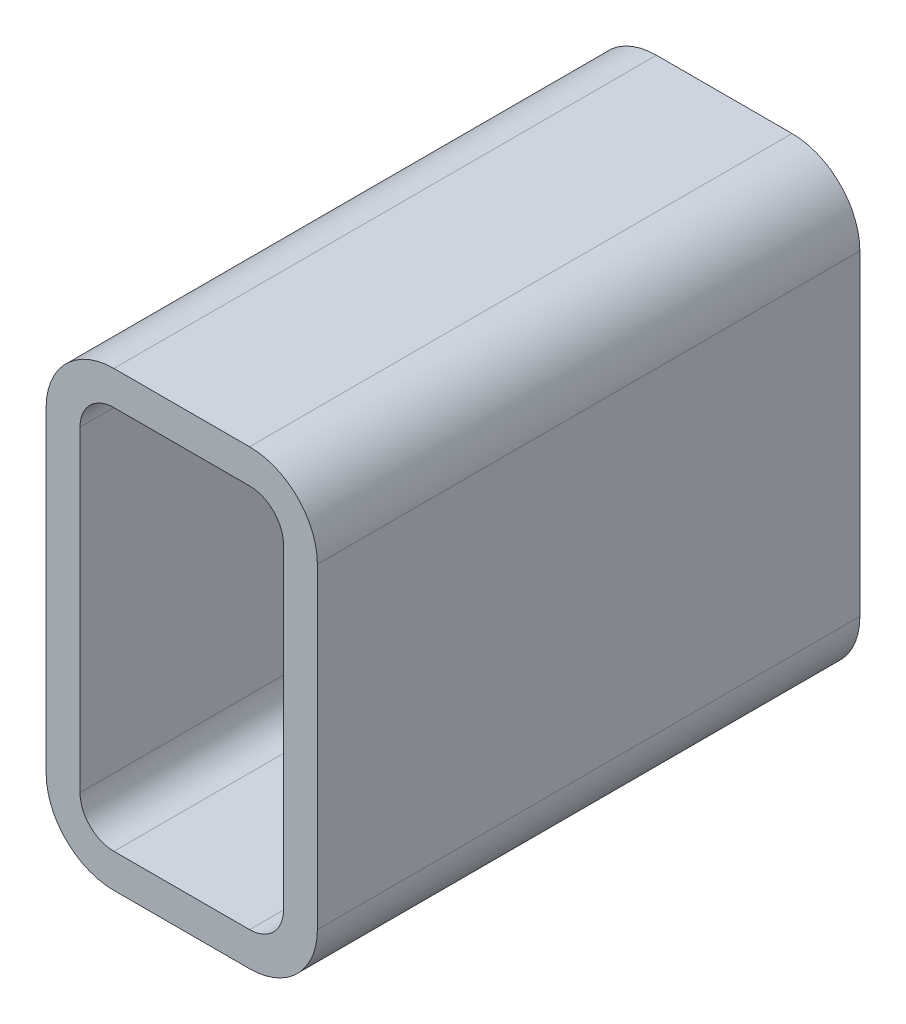
ISO-10303-21;
HEADER;
FILE_DESCRIPTION(('STEP AP214'),'2;1');
FILE_NAME('part.step','',(''),(''),'','','');
FILE_SCHEMA(('AUTOMOTIVE_DESIGN { 1 0 10303 214 1 1 1 1 }'));
ENDSEC;
DATA;
#1=APPLICATION_CONTEXT('core data for automotive mechanical design processes');
#2=APPLICATION_PROTOCOL_DEFINITION('international standard','automotive_design',2000,#1);
#3=PRODUCT_CONTEXT('',#1,'mechanical');
#4=PRODUCT('Part','Part','',(#3));
#5=PRODUCT_RELATED_PRODUCT_CATEGORY('part','',(#4));
#6=PRODUCT_DEFINITION_FORMATION('','',#4);
#7=PRODUCT_DEFINITION_CONTEXT('part definition',#1,'design');
#8=PRODUCT_DEFINITION('design','',#6,#7);
#9=PRODUCT_DEFINITION_SHAPE('','',#8);
#10=(LENGTH_UNIT() NAMED_UNIT(*) SI_UNIT(.MILLI.,.METRE.));
#11=(NAMED_UNIT(*) PLANE_ANGLE_UNIT() SI_UNIT($,.RADIAN.));
#12=(NAMED_UNIT(*) SI_UNIT($,.STERADIAN.) SOLID_ANGLE_UNIT());
#13=UNCERTAINTY_MEASURE_WITH_UNIT(LENGTH_MEASURE(1.E-05),#10,'distance_accuracy_value','');
#14=(GEOMETRIC_REPRESENTATION_CONTEXT(3) GLOBAL_UNCERTAINTY_ASSIGNED_CONTEXT((#13)) GLOBAL_UNIT_ASSIGNED_CONTEXT((#10,
#11,#12)) REPRESENTATION_CONTEXT('',''));
#15=CARTESIAN_POINT('',(0.,0.,0.));
#16=DIRECTION('',(0.,0.,1.));
#17=DIRECTION('',(1.,0.,0.));
#18=AXIS2_PLACEMENT_3D('',#15,#16,#17);
#19=CARTESIAN_POINT('',(57.15,107.95,76.2));
#20=DIRECTION('',(0.,0.,1.));
#21=DIRECTION('',(1.,0.,0.));
#22=AXIS2_PLACEMENT_3D('',#19,#20,#21);
#23=PLANE('',#22);
#24=CARTESIAN_POINT('',(57.15,107.95,76.2));
#25=DIRECTION('',(0.,0.,1.));
#26=DIRECTION('',(1.,0.,0.));
#27=AXIS2_PLACEMENT_3D('',#24,#25,#26);
#28=CIRCLE('',#27,19.05);
#29=CARTESIAN_POINT('',(76.2,107.95,76.2));
#30=VERTEX_POINT('',#29);
#31=CARTESIAN_POINT('',(57.15,127.,76.2));
#32=VERTEX_POINT('',#31);
#33=EDGE_CURVE('E215',#30,#32,#28,.T.);
#34=ORIENTED_EDGE('',*,*,#33,.T.);
#35=DIRECTION('',(-1.,0.,0.));
#36=VECTOR('',#35,1.);
#37=CARTESIAN_POINT('',(57.15,127.,76.2));
#38=LINE('',#37,#36);
#39=CARTESIAN_POINT('',(19.05,127.,76.2));
#40=VERTEX_POINT('',#39);
#41=EDGE_CURVE('E218',#32,#40,#38,.T.);
#42=ORIENTED_EDGE('',*,*,#41,.T.);
#43=CARTESIAN_POINT('',(19.05,107.95,76.2));
#44=DIRECTION('',(0.,0.,1.));
#45=DIRECTION('',(1.,0.,0.));
#46=AXIS2_PLACEMENT_3D('',#43,#44,#45);
#47=CIRCLE('',#46,19.05);
#48=CARTESIAN_POINT('',(0.,107.95,76.2));
#49=VERTEX_POINT('',#48);
#50=EDGE_CURVE('E221',#40,#49,#47,.T.);
#51=ORIENTED_EDGE('',*,*,#50,.T.);
#52=DIRECTION('',(0.,-1.,0.));
#53=VECTOR('',#52,1.);
#54=CARTESIAN_POINT('',(0.,19.05,76.2));
#55=LINE('',#54,#53);
#56=CARTESIAN_POINT('',(0.,19.05,76.2));
#57=VERTEX_POINT('',#56);
#58=EDGE_CURVE('E223',#49,#57,#55,.T.);
#59=ORIENTED_EDGE('',*,*,#58,.T.);
#60=CARTESIAN_POINT('',(19.05,19.05,76.2));
#61=DIRECTION('',(0.,0.,1.));
#62=DIRECTION('',(1.,0.,0.));
#63=AXIS2_PLACEMENT_3D('',#60,#61,#62);
#64=CIRCLE('',#63,19.05);
#65=CARTESIAN_POINT('',(19.05,0.,76.2));
#66=VERTEX_POINT('',#65);
#67=EDGE_CURVE('E225',#57,#66,#64,.T.);
#68=ORIENTED_EDGE('',*,*,#67,.T.);
#69=DIRECTION('',(1.,0.,0.));
#70=VECTOR('',#69,1.);
#71=CARTESIAN_POINT('',(19.05,0.,76.2));
#72=LINE('',#71,#70);
#73=CARTESIAN_POINT('',(57.15,0.,76.2));
#74=VERTEX_POINT('',#73);
#75=EDGE_CURVE('E227',#66,#74,#72,.T.);
#76=ORIENTED_EDGE('',*,*,#75,.T.);
#77=CARTESIAN_POINT('',(57.15,19.05,76.2));
#78=DIRECTION('',(0.,0.,1.));
#79=DIRECTION('',(1.,0.,0.));
#80=AXIS2_PLACEMENT_3D('',#77,#78,#79);
#81=CIRCLE('',#80,19.05);
#82=CARTESIAN_POINT('',(76.2,19.05,76.2));
#83=VERTEX_POINT('',#82);
#84=EDGE_CURVE('E229',#74,#83,#81,.T.);
#85=ORIENTED_EDGE('',*,*,#84,.T.);
#86=DIRECTION('',(0.,1.,0.));
#87=VECTOR('',#86,1.);
#88=CARTESIAN_POINT('',(76.2,107.95,76.2));
#89=LINE('',#88,#87);
#90=EDGE_CURVE('E231',#83,#30,#89,.T.);
#91=ORIENTED_EDGE('',*,*,#90,.T.);
#92=EDGE_LOOP('',(#34,#42,#51,#59,#68,#76,#85,#91));
#93=FACE_BOUND('',#92,.T.);
#94=DIRECTION('',(0.,-1.,0.));
#95=VECTOR('',#94,1.);
#96=CARTESIAN_POINT('',(9.525,19.05,76.2));
#97=LINE('',#96,#95);
#98=CARTESIAN_POINT('',(9.525,107.95,76.2));
#99=VERTEX_POINT('',#98);
#100=CARTESIAN_POINT('',(9.525,19.05,76.2));
#101=VERTEX_POINT('',#100);
#102=EDGE_CURVE('E156',#99,#101,#97,.T.);
#103=ORIENTED_EDGE('',*,*,#102,.F.);
#104=CARTESIAN_POINT('',(19.05,107.95,76.2));
#105=DIRECTION('',(0.,0.,1.));
#106=DIRECTION('',(1.,0.,0.));
#107=AXIS2_PLACEMENT_3D('',#104,#105,#106);
#108=CIRCLE('',#107,9.52499999999999);
#109=CARTESIAN_POINT('',(19.05,117.475,76.2));
#110=VERTEX_POINT('',#109);
#111=EDGE_CURVE('E148',#110,#99,#108,.T.);
#112=ORIENTED_EDGE('',*,*,#111,.F.);
#113=DIRECTION('',(-1.,0.,0.));
#114=VECTOR('',#113,1.);
#115=CARTESIAN_POINT('',(57.15,117.475,76.2));
#116=LINE('',#115,#114);
#117=CARTESIAN_POINT('',(57.15,117.475,76.2));
#118=VERTEX_POINT('',#117);
#119=EDGE_CURVE('E182',#118,#110,#116,.T.);
#120=ORIENTED_EDGE('',*,*,#119,.F.);
#121=CARTESIAN_POINT('',(57.15,107.95,76.2));
#122=DIRECTION('',(0.,0.,1.));
#123=DIRECTION('',(1.,0.,0.));
#124=AXIS2_PLACEMENT_3D('',#121,#122,#123);
#125=CIRCLE('',#124,9.52500000000001);
#126=CARTESIAN_POINT('',(66.675,107.95,76.2));
#127=VERTEX_POINT('',#126);
#128=EDGE_CURVE('E180',#127,#118,#125,.T.);
#129=ORIENTED_EDGE('',*,*,#128,.F.);
#130=DIRECTION('',(0.,1.,0.));
#131=VECTOR('',#130,1.);
#132=CARTESIAN_POINT('',(66.675,107.95,76.2));
#133=LINE('',#132,#131);
#134=CARTESIAN_POINT('',(66.675,19.05,76.2));
#135=VERTEX_POINT('',#134);
#136=EDGE_CURVE('E178',#135,#127,#133,.T.);
#137=ORIENTED_EDGE('',*,*,#136,.F.);
#138=CARTESIAN_POINT('',(57.15,19.05,76.2));
#139=DIRECTION('',(0.,0.,1.));
#140=DIRECTION('',(1.,0.,0.));
#141=AXIS2_PLACEMENT_3D('',#138,#139,#140);
#142=CIRCLE('',#141,9.52499999999999);
#143=CARTESIAN_POINT('',(57.15,9.52500000000001,76.2));
#144=VERTEX_POINT('',#143);
#145=EDGE_CURVE('E176',#144,#135,#142,.T.);
#146=ORIENTED_EDGE('',*,*,#145,.F.);
#147=DIRECTION('',(1.,0.,0.));
#148=VECTOR('',#147,1.);
#149=CARTESIAN_POINT('',(19.05,9.525,76.2));
#150=LINE('',#149,#148);
#151=CARTESIAN_POINT('',(19.05,9.525,76.2));
#152=VERTEX_POINT('',#151);
#153=EDGE_CURVE('E171',#152,#144,#150,.T.);
#154=ORIENTED_EDGE('',*,*,#153,.F.);
#155=CARTESIAN_POINT('',(19.05,19.05,76.2));
#156=DIRECTION('',(0.,0.,1.));
#157=DIRECTION('',(1.,0.,0.));
#158=AXIS2_PLACEMENT_3D('',#155,#156,#157);
#159=CIRCLE('',#158,9.525);
#160=EDGE_CURVE('E169',#101,#152,#159,.T.);
#161=ORIENTED_EDGE('',*,*,#160,.F.);
#162=EDGE_LOOP('',(#103,#112,#120,#129,#137,#146,#154,#161));
#163=FACE_BOUND('',#162,.T.);
#164=ADVANCED_FACE('F35',(#93,#163),#23,.T.);
#165=CARTESIAN_POINT('',(57.15,107.95,-76.2));
#166=DIRECTION('',(0.,0.,1.));
#167=DIRECTION('',(1.,0.,0.));
#168=AXIS2_PLACEMENT_3D('',#165,#166,#167);
#169=PLANE('',#168);
#170=CARTESIAN_POINT('',(57.15,107.95,-76.2));
#171=DIRECTION('',(0.,0.,1.));
#172=DIRECTION('',(1.,0.,0.));
#173=AXIS2_PLACEMENT_3D('',#170,#171,#172);
#174=CIRCLE('',#173,19.05);
#175=CARTESIAN_POINT('',(76.2,107.95,-76.2));
#176=VERTEX_POINT('',#175);
#177=CARTESIAN_POINT('',(57.15,127.,-76.2));
#178=VERTEX_POINT('',#177);
#179=EDGE_CURVE('E164',#176,#178,#174,.T.);
#180=ORIENTED_EDGE('',*,*,#179,.F.);
#181=DIRECTION('',(0.,1.,0.));
#182=VECTOR('',#181,1.);
#183=CARTESIAN_POINT('',(76.2,107.95,-76.2));
#184=LINE('',#183,#182);
#185=CARTESIAN_POINT('',(76.2,19.05,-76.2));
#186=VERTEX_POINT('',#185);
#187=EDGE_CURVE('E219',#186,#176,#184,.T.);
#188=ORIENTED_EDGE('',*,*,#187,.F.);
#189=CARTESIAN_POINT('',(57.15,19.05,-76.2));
#190=DIRECTION('',(0.,0.,1.));
#191=DIRECTION('',(1.,0.,0.));
#192=AXIS2_PLACEMENT_3D('',#189,#190,#191);
#193=CIRCLE('',#192,19.05);
#194=CARTESIAN_POINT('',(57.15,0.,-76.2));
#195=VERTEX_POINT('',#194);
#196=EDGE_CURVE('E246',#195,#186,#193,.T.);
#197=ORIENTED_EDGE('',*,*,#196,.F.);
#198=DIRECTION('',(1.,0.,0.));
#199=VECTOR('',#198,1.);
#200=CARTESIAN_POINT('',(19.05,0.,-76.2));
#201=LINE('',#200,#199);
#202=CARTESIAN_POINT('',(19.05,0.,-76.2));
#203=VERTEX_POINT('',#202);
#204=EDGE_CURVE('E244',#203,#195,#201,.T.);
#205=ORIENTED_EDGE('',*,*,#204,.F.);
#206=CARTESIAN_POINT('',(19.05,19.05,-76.2));
#207=DIRECTION('',(0.,0.,1.));
#208=DIRECTION('',(1.,0.,0.));
#209=AXIS2_PLACEMENT_3D('',#206,#207,#208);
#210=CIRCLE('',#209,19.05);
#211=CARTESIAN_POINT('',(0.,19.05,-76.2));
#212=VERTEX_POINT('',#211);
#213=EDGE_CURVE('E242',#212,#203,#210,.T.);
#214=ORIENTED_EDGE('',*,*,#213,.F.);
#215=DIRECTION('',(0.,-1.,0.));
#216=VECTOR('',#215,1.);
#217=CARTESIAN_POINT('',(0.,19.05,-76.2));
#218=LINE('',#217,#216);
#219=CARTESIAN_POINT('',(0.,107.95,-76.2));
#220=VERTEX_POINT('',#219);
#221=EDGE_CURVE('E240',#220,#212,#218,.T.);
#222=ORIENTED_EDGE('',*,*,#221,.F.);
#223=CARTESIAN_POINT('',(19.05,107.95,-76.2));
#224=DIRECTION('',(0.,0.,1.));
#225=DIRECTION('',(1.,0.,0.));
#226=AXIS2_PLACEMENT_3D('',#223,#224,#225);
#227=CIRCLE('',#226,19.05);
#228=CARTESIAN_POINT('',(19.05,127.,-76.2));
#229=VERTEX_POINT('',#228);
#230=EDGE_CURVE('E238',#229,#220,#227,.T.);
#231=ORIENTED_EDGE('',*,*,#230,.F.);
#232=DIRECTION('',(-1.,0.,0.));
#233=VECTOR('',#232,1.);
#234=CARTESIAN_POINT('',(57.15,127.,-76.2));
#235=LINE('',#234,#233);
#236=EDGE_CURVE('E236',#178,#229,#235,.T.);
#237=ORIENTED_EDGE('',*,*,#236,.F.);
#238=EDGE_LOOP('',(#180,#188,#197,#205,#214,#222,#231,#237));
#239=FACE_BOUND('',#238,.T.);
#240=CARTESIAN_POINT('',(19.05,107.95,-76.2));
#241=DIRECTION('',(0.,0.,1.));
#242=DIRECTION('',(1.,0.,0.));
#243=AXIS2_PLACEMENT_3D('',#240,#241,#242);
#244=CIRCLE('',#243,9.52499999999999);
#245=CARTESIAN_POINT('',(19.05,117.475,-76.2));
#246=VERTEX_POINT('',#245);
#247=CARTESIAN_POINT('',(9.525,107.95,-76.2));
#248=VERTEX_POINT('',#247);
#249=EDGE_CURVE('E58',#246,#248,#244,.T.);
#250=ORIENTED_EDGE('',*,*,#249,.T.);
#251=DIRECTION('',(0.,-1.,0.));
#252=VECTOR('',#251,1.);
#253=CARTESIAN_POINT('',(9.525,19.05,-76.2));
#254=LINE('',#253,#252);
#255=CARTESIAN_POINT('',(9.525,19.05,-76.2));
#256=VERTEX_POINT('',#255);
#257=EDGE_CURVE('E163',#248,#256,#254,.T.);
#258=ORIENTED_EDGE('',*,*,#257,.T.);
#259=CARTESIAN_POINT('',(19.05,19.05,-76.2));
#260=DIRECTION('',(0.,0.,1.));
#261=DIRECTION('',(1.,0.,0.));
#262=AXIS2_PLACEMENT_3D('',#259,#260,#261);
#263=CIRCLE('',#262,9.525);
#264=CARTESIAN_POINT('',(19.05,9.525,-76.2));
#265=VERTEX_POINT('',#264);
#266=EDGE_CURVE('E187',#256,#265,#263,.T.);
#267=ORIENTED_EDGE('',*,*,#266,.T.);
#268=DIRECTION('',(1.,0.,0.));
#269=VECTOR('',#268,1.);
#270=CARTESIAN_POINT('',(19.05,9.525,-76.2));
#271=LINE('',#270,#269);
#272=CARTESIAN_POINT('',(57.15,9.52500000000001,-76.2));
#273=VERTEX_POINT('',#272);
#274=EDGE_CURVE('E190',#265,#273,#271,.T.);
#275=ORIENTED_EDGE('',*,*,#274,.T.);
#276=CARTESIAN_POINT('',(57.15,19.05,-76.2));
#277=DIRECTION('',(0.,0.,1.));
#278=DIRECTION('',(1.,0.,0.));
#279=AXIS2_PLACEMENT_3D('',#276,#277,#278);
#280=CIRCLE('',#279,9.52499999999999);
#281=CARTESIAN_POINT('',(66.675,19.05,-76.2));
#282=VERTEX_POINT('',#281);
#283=EDGE_CURVE('E193',#273,#282,#280,.T.);
#284=ORIENTED_EDGE('',*,*,#283,.T.);
#285=DIRECTION('',(0.,1.,0.));
#286=VECTOR('',#285,1.);
#287=CARTESIAN_POINT('',(66.675,107.95,-76.2));
#288=LINE('',#287,#286);
#289=CARTESIAN_POINT('',(66.675,107.95,-76.2));
#290=VERTEX_POINT('',#289);
#291=EDGE_CURVE('E196',#282,#290,#288,.T.);
#292=ORIENTED_EDGE('',*,*,#291,.T.);
#293=CARTESIAN_POINT('',(57.15,107.95,-76.2));
#294=DIRECTION('',(0.,0.,1.));
#295=DIRECTION('',(1.,0.,0.));
#296=AXIS2_PLACEMENT_3D('',#293,#294,#295);
#297=CIRCLE('',#296,9.52500000000001);
#298=CARTESIAN_POINT('',(57.15,117.475,-76.2));
#299=VERTEX_POINT('',#298);
#300=EDGE_CURVE('E199',#290,#299,#297,.T.);
#301=ORIENTED_EDGE('',*,*,#300,.T.);
#302=DIRECTION('',(-1.,0.,0.));
#303=VECTOR('',#302,1.);
#304=CARTESIAN_POINT('',(57.15,117.475,-76.2));
#305=LINE('',#304,#303);
#306=EDGE_CURVE('E157',#299,#246,#305,.T.);
#307=ORIENTED_EDGE('',*,*,#306,.T.);
#308=EDGE_LOOP('',(#250,#258,#267,#275,#284,#292,#301,#307));
#309=FACE_BOUND('',#308,.T.);
#310=ADVANCED_FACE('F276',(#239,#309),#169,.F.);
#311=CARTESIAN_POINT('',(57.15,107.95,76.2));
#312=DIRECTION('',(0.,0.,-1.));
#313=DIRECTION('',(-1.,0.,0.));
#314=AXIS2_PLACEMENT_3D('',#311,#312,#313);
#315=CYLINDRICAL_SURFACE('',#314,19.05);
#316=ORIENTED_EDGE('',*,*,#179,.T.);
#317=DIRECTION('',(0.,0.,-1.));
#318=VECTOR('',#317,1.);
#319=CARTESIAN_POINT('',(57.15,127.,76.2));
#320=LINE('',#319,#318);
#321=EDGE_CURVE('E11',#32,#178,#320,.T.);
#322=ORIENTED_EDGE('',*,*,#321,.F.);
#323=ORIENTED_EDGE('',*,*,#33,.F.);
#324=DIRECTION('',(0.,0.,-1.));
#325=VECTOR('',#324,1.);
#326=CARTESIAN_POINT('',(76.2,107.95,76.2));
#327=LINE('',#326,#325);
#328=EDGE_CURVE('E233',#30,#176,#327,.T.);
#329=ORIENTED_EDGE('',*,*,#328,.T.);
#330=EDGE_LOOP('',(#316,#322,#323,#329));
#331=FACE_BOUND('',#330,.T.);
#332=ADVANCED_FACE('F37',(#331),#315,.T.);
#333=CARTESIAN_POINT('',(57.15,127.,76.2));
#334=DIRECTION('',(0.,-1.,0.));
#335=DIRECTION('',(0.,0.,-1.));
#336=AXIS2_PLACEMENT_3D('',#333,#334,#335);
#337=PLANE('',#336);
#338=ORIENTED_EDGE('',*,*,#236,.T.);
#339=DIRECTION('',(0.,0.,-1.));
#340=VECTOR('',#339,1.);
#341=CARTESIAN_POINT('',(19.05,127.,76.2));
#342=LINE('',#341,#340);
#343=EDGE_CURVE('E43',#40,#229,#342,.T.);
#344=ORIENTED_EDGE('',*,*,#343,.F.);
#345=ORIENTED_EDGE('',*,*,#41,.F.);
#346=ORIENTED_EDGE('',*,*,#321,.T.);
#347=EDGE_LOOP('',(#338,#344,#345,#346));
#348=FACE_BOUND('',#347,.T.);
#349=ADVANCED_FACE('F293',(#348),#337,.F.);
#350=CARTESIAN_POINT('',(19.05,107.95,76.2));
#351=DIRECTION('',(0.,0.,-1.));
#352=DIRECTION('',(-1.,0.,0.));
#353=AXIS2_PLACEMENT_3D('',#350,#351,#352);
#354=CYLINDRICAL_SURFACE('',#353,19.05);
#355=ORIENTED_EDGE('',*,*,#230,.T.);
#356=DIRECTION('',(0.,0.,-1.));
#357=VECTOR('',#356,1.);
#358=CARTESIAN_POINT('',(0.,107.95,76.2));
#359=LINE('',#358,#357);
#360=EDGE_CURVE('E263',#49,#220,#359,.T.);
#361=ORIENTED_EDGE('',*,*,#360,.F.);
#362=ORIENTED_EDGE('',*,*,#50,.F.);
#363=ORIENTED_EDGE('',*,*,#343,.T.);
#364=EDGE_LOOP('',(#355,#361,#362,#363));
#365=FACE_BOUND('',#364,.T.);
#366=ADVANCED_FACE('F270',(#365),#354,.T.);
#367=CARTESIAN_POINT('',(0.,19.05,76.2));
#368=DIRECTION('',(1.,0.,0.));
#369=DIRECTION('',(0.,0.,-1.));
#370=AXIS2_PLACEMENT_3D('',#367,#368,#369);
#371=PLANE('',#370);
#372=CARTESIAN_POINT('',(0.,31.75,-38.1));
#373=DIRECTION('',(-1.,0.,0.));
#374=DIRECTION('',(0.,0.,1.));
#375=AXIS2_PLACEMENT_3D('',#372,#373,#374);
#376=CIRCLE('',#375,9.525);
#377=CARTESIAN_POINT('',(0.,31.75,-28.575));
#378=VERTEX_POINT('',#377);
#379=EDGE_CURVE('E185',#378,#378,#376,.T.);
#380=ORIENTED_EDGE('',*,*,#379,.F.);
#381=EDGE_LOOP('',(#380));
#382=FACE_BOUND('',#381,.T.);
#383=ORIENTED_EDGE('',*,*,#221,.T.);
#384=DIRECTION('',(0.,0.,-1.));
#385=VECTOR('',#384,1.);
#386=CARTESIAN_POINT('',(0.,19.05,76.2));
#387=LINE('',#386,#385);
#388=EDGE_CURVE('E260',#57,#212,#387,.T.);
#389=ORIENTED_EDGE('',*,*,#388,.F.);
#390=ORIENTED_EDGE('',*,*,#58,.F.);
#391=ORIENTED_EDGE('',*,*,#360,.T.);
#392=EDGE_LOOP('',(#383,#389,#390,#391));
#393=FACE_BOUND('',#392,.T.);
#394=ADVANCED_FACE('F282',(#382,#393),#371,.F.);
#395=CARTESIAN_POINT('',(19.05,19.05,76.2));
#396=DIRECTION('',(0.,0.,-1.));
#397=DIRECTION('',(-1.,0.,0.));
#398=AXIS2_PLACEMENT_3D('',#395,#396,#397);
#399=CYLINDRICAL_SURFACE('',#398,19.05);
#400=ORIENTED_EDGE('',*,*,#213,.T.);
#401=DIRECTION('',(0.,0.,-1.));
#402=VECTOR('',#401,1.);
#403=CARTESIAN_POINT('',(19.05,0.,76.2));
#404=LINE('',#403,#402);
#405=EDGE_CURVE('E257',#66,#203,#404,.T.);
#406=ORIENTED_EDGE('',*,*,#405,.F.);
#407=ORIENTED_EDGE('',*,*,#67,.F.);
#408=ORIENTED_EDGE('',*,*,#388,.T.);
#409=EDGE_LOOP('',(#400,#406,#407,#408));
#410=FACE_BOUND('',#409,.T.);
#411=ADVANCED_FACE('F286',(#410),#399,.T.);
#412=CARTESIAN_POINT('',(19.05,0.,76.2));
#413=DIRECTION('',(0.,1.,0.));
#414=DIRECTION('',(-1.,0.,0.));
#415=AXIS2_PLACEMENT_3D('',#412,#413,#414);
#416=PLANE('',#415);
#417=ORIENTED_EDGE('',*,*,#204,.T.);
#418=DIRECTION('',(0.,0.,-1.));
#419=VECTOR('',#418,1.);
#420=CARTESIAN_POINT('',(57.15,0.,76.2));
#421=LINE('',#420,#419);
#422=EDGE_CURVE('E254',#74,#195,#421,.T.);
#423=ORIENTED_EDGE('',*,*,#422,.F.);
#424=ORIENTED_EDGE('',*,*,#75,.F.);
#425=ORIENTED_EDGE('',*,*,#405,.T.);
#426=EDGE_LOOP('',(#417,#423,#424,#425));
#427=FACE_BOUND('',#426,.T.);
#428=ADVANCED_FACE('F306',(#427),#416,.F.);
#429=CARTESIAN_POINT('',(57.15,19.05,76.2));
#430=DIRECTION('',(0.,0.,-1.));
#431=DIRECTION('',(-1.,0.,0.));
#432=AXIS2_PLACEMENT_3D('',#429,#430,#431);
#433=CYLINDRICAL_SURFACE('',#432,19.05);
#434=ORIENTED_EDGE('',*,*,#196,.T.);
#435=DIRECTION('',(0.,0.,-1.));
#436=VECTOR('',#435,1.);
#437=CARTESIAN_POINT('',(76.2,19.05,76.2));
#438=LINE('',#437,#436);
#439=EDGE_CURVE('E251',#83,#186,#438,.T.);
#440=ORIENTED_EDGE('',*,*,#439,.F.);
#441=ORIENTED_EDGE('',*,*,#84,.F.);
#442=ORIENTED_EDGE('',*,*,#422,.T.);
#443=EDGE_LOOP('',(#434,#440,#441,#442));
#444=FACE_BOUND('',#443,.T.);
#445=ADVANCED_FACE('F304',(#444),#433,.T.);
#446=CARTESIAN_POINT('',(76.2,107.95,76.2));
#447=DIRECTION('',(-1.,0.,0.));
#448=DIRECTION('',(0.,-1.,0.));
#449=AXIS2_PLACEMENT_3D('',#446,#447,#448);
#450=PLANE('',#449);
#451=ORIENTED_EDGE('',*,*,#187,.T.);
#452=ORIENTED_EDGE('',*,*,#328,.F.);
#453=ORIENTED_EDGE('',*,*,#90,.F.);
#454=ORIENTED_EDGE('',*,*,#439,.T.);
#455=EDGE_LOOP('',(#451,#452,#453,#454));
#456=FACE_BOUND('',#455,.T.);
#457=ADVANCED_FACE('F299',(#456),#450,.F.);
#458=CARTESIAN_POINT('',(19.05,107.95,76.2));
#459=DIRECTION('',(0.,0.,-1.));
#460=DIRECTION('',(-1.,0.,0.));
#461=AXIS2_PLACEMENT_3D('',#458,#459,#460);
#462=CYLINDRICAL_SURFACE('',#461,9.52499999999999);
#463=ORIENTED_EDGE('',*,*,#249,.F.);
#464=DIRECTION('',(0.,0.,-1.));
#465=VECTOR('',#464,1.);
#466=CARTESIAN_POINT('',(19.05,117.475,76.2));
#467=LINE('',#466,#465);
#468=EDGE_CURVE('E152',#110,#246,#467,.T.);
#469=ORIENTED_EDGE('',*,*,#468,.F.);
#470=ORIENTED_EDGE('',*,*,#111,.T.);
#471=DIRECTION('',(0.,0.,-1.));
#472=VECTOR('',#471,1.);
#473=CARTESIAN_POINT('',(9.525,107.95,76.2));
#474=LINE('',#473,#472);
#475=EDGE_CURVE('E151',#99,#248,#474,.T.);
#476=ORIENTED_EDGE('',*,*,#475,.T.);
#477=EDGE_LOOP('',(#463,#469,#470,#476));
#478=FACE_BOUND('',#477,.T.);
#479=ADVANCED_FACE('F150',(#478),#462,.F.);
#480=CARTESIAN_POINT('',(9.525,19.05,76.2));
#481=DIRECTION('',(1.,0.,0.));
#482=DIRECTION('',(0.,1.,0.));
#483=AXIS2_PLACEMENT_3D('',#480,#481,#482);
#484=PLANE('',#483);
#485=CARTESIAN_POINT('',(9.52500000000001,31.75,-38.1));
#486=DIRECTION('',(1.,0.,0.));
#487=DIRECTION('',(0.,1.,0.));
#488=AXIS2_PLACEMENT_3D('',#485,#486,#487);
#489=CIRCLE('',#488,9.525);
#490=CARTESIAN_POINT('',(9.52500000000001,41.275,-38.1));
#491=VERTEX_POINT('',#490);
#492=EDGE_CURVE('E366',#491,#491,#489,.F.);
#493=ORIENTED_EDGE('',*,*,#492,.T.);
#494=EDGE_LOOP('',(#493));
#495=FACE_BOUND('',#494,.T.);
#496=ORIENTED_EDGE('',*,*,#257,.F.);
#497=ORIENTED_EDGE('',*,*,#475,.F.);
#498=ORIENTED_EDGE('',*,*,#102,.T.);
#499=DIRECTION('',(0.,0.,-1.));
#500=VECTOR('',#499,1.);
#501=CARTESIAN_POINT('',(9.525,19.05,76.2));
#502=LINE('',#501,#500);
#503=EDGE_CURVE('E165',#101,#256,#502,.T.);
#504=ORIENTED_EDGE('',*,*,#503,.T.);
#505=EDGE_LOOP('',(#496,#497,#498,#504));
#506=FACE_BOUND('',#505,.T.);
#507=ADVANCED_FACE('F160',(#495,#506),#484,.T.);
#508=CARTESIAN_POINT('',(19.05,19.05,76.2));
#509=DIRECTION('',(0.,0.,-1.));
#510=DIRECTION('',(-1.,0.,0.));
#511=AXIS2_PLACEMENT_3D('',#508,#509,#510);
#512=CYLINDRICAL_SURFACE('',#511,9.525);
#513=ORIENTED_EDGE('',*,*,#266,.F.);
#514=ORIENTED_EDGE('',*,*,#503,.F.);
#515=ORIENTED_EDGE('',*,*,#160,.T.);
#516=DIRECTION('',(0.,0.,-1.));
#517=VECTOR('',#516,1.);
#518=CARTESIAN_POINT('',(19.05,9.525,76.2));
#519=LINE('',#518,#517);
#520=EDGE_CURVE('E212',#152,#265,#519,.T.);
#521=ORIENTED_EDGE('',*,*,#520,.T.);
#522=EDGE_LOOP('',(#513,#514,#515,#521));
#523=FACE_BOUND('',#522,.T.);
#524=ADVANCED_FACE('F331',(#523),#512,.F.);
#525=CARTESIAN_POINT('',(19.05,9.525,76.2));
#526=DIRECTION('',(0.,1.,0.));
#527=DIRECTION('',(0.,0.,1.));
#528=AXIS2_PLACEMENT_3D('',#525,#526,#527);
#529=PLANE('',#528);
#530=ORIENTED_EDGE('',*,*,#274,.F.);
#531=ORIENTED_EDGE('',*,*,#520,.F.);
#532=ORIENTED_EDGE('',*,*,#153,.T.);
#533=DIRECTION('',(0.,0.,-1.));
#534=VECTOR('',#533,1.);
#535=CARTESIAN_POINT('',(57.15,9.52500000000001,76.2));
#536=LINE('',#535,#534);
#537=EDGE_CURVE('E210',#144,#273,#536,.T.);
#538=ORIENTED_EDGE('',*,*,#537,.T.);
#539=EDGE_LOOP('',(#530,#531,#532,#538));
#540=FACE_BOUND('',#539,.T.);
#541=ADVANCED_FACE('F336',(#540),#529,.T.);
#542=CARTESIAN_POINT('',(57.15,19.05,76.2));
#543=DIRECTION('',(0.,0.,-1.));
#544=DIRECTION('',(-1.,0.,0.));
#545=AXIS2_PLACEMENT_3D('',#542,#543,#544);
#546=CYLINDRICAL_SURFACE('',#545,9.52499999999999);
#547=ORIENTED_EDGE('',*,*,#283,.F.);
#548=ORIENTED_EDGE('',*,*,#537,.F.);
#549=ORIENTED_EDGE('',*,*,#145,.T.);
#550=DIRECTION('',(0.,0.,-1.));
#551=VECTOR('',#550,1.);
#552=CARTESIAN_POINT('',(66.675,19.05,76.2));
#553=LINE('',#552,#551);
#554=EDGE_CURVE('E208',#135,#282,#553,.T.);
#555=ORIENTED_EDGE('',*,*,#554,.T.);
#556=EDGE_LOOP('',(#547,#548,#549,#555));
#557=FACE_BOUND('',#556,.T.);
#558=ADVANCED_FACE('F343',(#557),#546,.F.);
#559=CARTESIAN_POINT('',(66.675,107.95,76.2));
#560=DIRECTION('',(-1.,0.,0.));
#561=DIRECTION('',(0.,-1.,0.));
#562=AXIS2_PLACEMENT_3D('',#559,#560,#561);
#563=PLANE('',#562);
#564=ORIENTED_EDGE('',*,*,#291,.F.);
#565=ORIENTED_EDGE('',*,*,#554,.F.);
#566=ORIENTED_EDGE('',*,*,#136,.T.);
#567=DIRECTION('',(0.,0.,-1.));
#568=VECTOR('',#567,1.);
#569=CARTESIAN_POINT('',(66.675,107.95,76.2));
#570=LINE('',#569,#568);
#571=EDGE_CURVE('E206',#127,#290,#570,.T.);
#572=ORIENTED_EDGE('',*,*,#571,.T.);
#573=EDGE_LOOP('',(#564,#565,#566,#572));
#574=FACE_BOUND('',#573,.T.);
#575=ADVANCED_FACE('F347',(#574),#563,.T.);
#576=CARTESIAN_POINT('',(57.15,107.95,76.2));
#577=DIRECTION('',(0.,0.,-1.));
#578=DIRECTION('',(-1.,0.,0.));
#579=AXIS2_PLACEMENT_3D('',#576,#577,#578);
#580=CYLINDRICAL_SURFACE('',#579,9.52500000000001);
#581=ORIENTED_EDGE('',*,*,#300,.F.);
#582=ORIENTED_EDGE('',*,*,#571,.F.);
#583=ORIENTED_EDGE('',*,*,#128,.T.);
#584=DIRECTION('',(0.,0.,-1.));
#585=VECTOR('',#584,1.);
#586=CARTESIAN_POINT('',(57.15,117.475,76.2));
#587=LINE('',#586,#585);
#588=EDGE_CURVE('E50',#118,#299,#587,.T.);
#589=ORIENTED_EDGE('',*,*,#588,.T.);
#590=EDGE_LOOP('',(#581,#582,#583,#589));
#591=FACE_BOUND('',#590,.T.);
#592=ADVANCED_FACE('F351',(#591),#580,.F.);
#593=CARTESIAN_POINT('',(57.15,117.475,76.2));
#594=DIRECTION('',(0.,-1.,0.));
#595=DIRECTION('',(1.,0.,0.));
#596=AXIS2_PLACEMENT_3D('',#593,#594,#595);
#597=PLANE('',#596);
#598=ORIENTED_EDGE('',*,*,#306,.F.);
#599=ORIENTED_EDGE('',*,*,#588,.F.);
#600=ORIENTED_EDGE('',*,*,#119,.T.);
#601=ORIENTED_EDGE('',*,*,#468,.T.);
#602=EDGE_LOOP('',(#598,#599,#600,#601));
#603=FACE_BOUND('',#602,.T.);
#604=ADVANCED_FACE('F355',(#603),#597,.T.);
#605=CARTESIAN_POINT('',(76.201,31.75,-38.1));
#606=DIRECTION('',(-1.,0.,0.));
#607=DIRECTION('',(0.,0.,1.));
#608=AXIS2_PLACEMENT_3D('',#605,#606,#607);
#609=CYLINDRICAL_SURFACE('',#608,9.525);
#610=ORIENTED_EDGE('',*,*,#492,.F.);
#611=EDGE_LOOP('',(#610));
#612=FACE_BOUND('',#611,.T.);
#613=ORIENTED_EDGE('',*,*,#379,.T.);
#614=EDGE_LOOP('',(#613));
#615=FACE_BOUND('',#614,.T.);
#616=ADVANCED_FACE('F359',(#612,#615),#609,.F.);
#617=CLOSED_SHELL('',(#164,#310,#332,#349,#366,#394,#411,#428,#445,#457,#479,#507,#524,#541,
#558,#575,#592,#604,#616));
#618=MANIFOLD_SOLID_BREP('B2',#617);
#619=ADVANCED_BREP_SHAPE_REPRESENTATION('',(#18,#618),#14);
#620=SHAPE_DEFINITION_REPRESENTATION(#9,#619);
ENDSEC;
END-ISO-10303-21;
